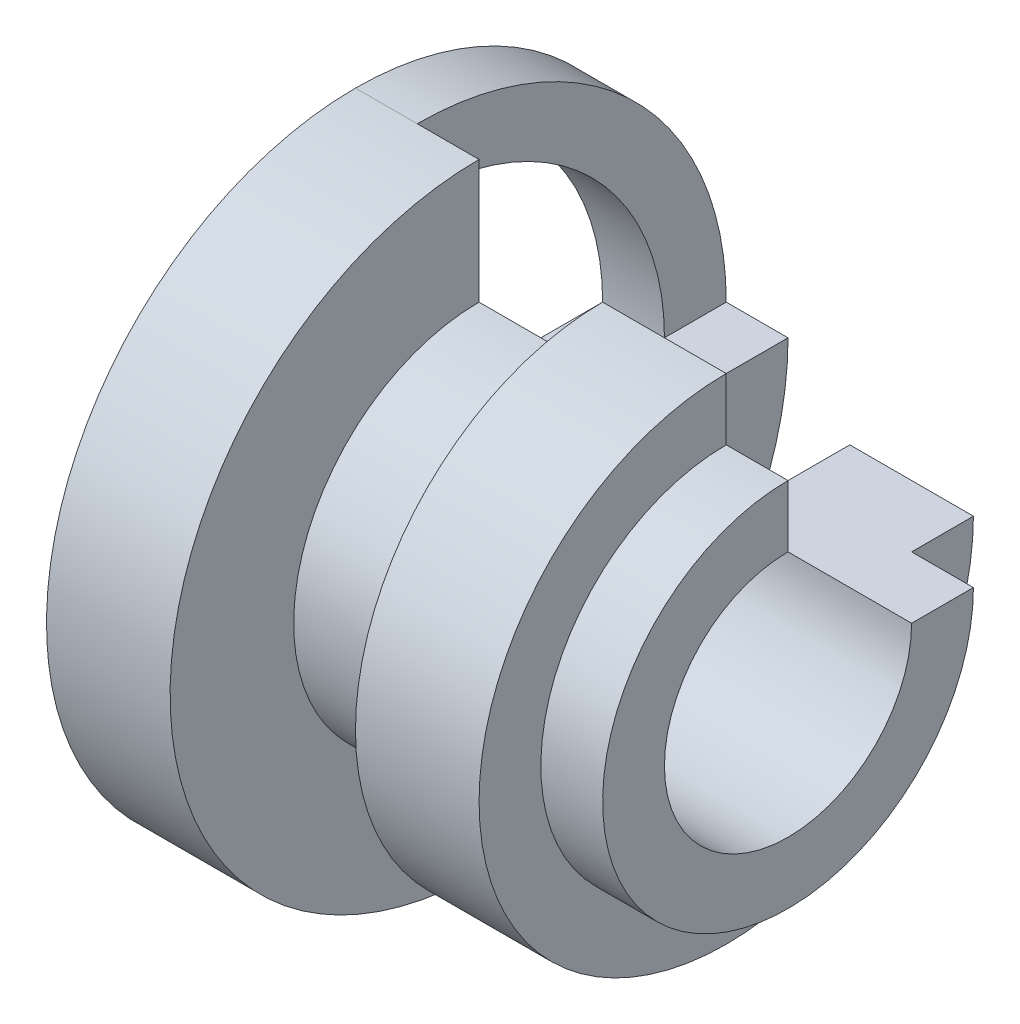
ISO-10303-21;
HEADER;
FILE_DESCRIPTION(('STEP AP214'),'2;1');
FILE_NAME('part.step','',(''),(''),'','','');
FILE_SCHEMA(('AUTOMOTIVE_DESIGN { 1 0 10303 214 1 1 1 1 }'));
ENDSEC;
DATA;
#1=APPLICATION_CONTEXT('core data for automotive mechanical design processes');
#2=APPLICATION_PROTOCOL_DEFINITION('international standard','automotive_design',2000,#1);
#3=PRODUCT_CONTEXT('',#1,'mechanical');
#4=PRODUCT('Part','Part','',(#3));
#5=PRODUCT_RELATED_PRODUCT_CATEGORY('part','',(#4));
#6=PRODUCT_DEFINITION_FORMATION('','',#4);
#7=PRODUCT_DEFINITION_CONTEXT('part definition',#1,'design');
#8=PRODUCT_DEFINITION('design','',#6,#7);
#9=PRODUCT_DEFINITION_SHAPE('','',#8);
#10=(LENGTH_UNIT() NAMED_UNIT(*) SI_UNIT(.MILLI.,.METRE.));
#11=(NAMED_UNIT(*) PLANE_ANGLE_UNIT() SI_UNIT($,.RADIAN.));
#12=(NAMED_UNIT(*) SI_UNIT($,.STERADIAN.) SOLID_ANGLE_UNIT());
#13=UNCERTAINTY_MEASURE_WITH_UNIT(LENGTH_MEASURE(1.E-05),#10,'distance_accuracy_value','');
#14=(GEOMETRIC_REPRESENTATION_CONTEXT(3) GLOBAL_UNCERTAINTY_ASSIGNED_CONTEXT((#13)) GLOBAL_UNIT_ASSIGNED_CONTEXT((#10,
#11,#12)) REPRESENTATION_CONTEXT('',''));
#15=CARTESIAN_POINT('',(0.,0.,0.));
#16=DIRECTION('',(0.,0.,1.));
#17=DIRECTION('',(1.,0.,0.));
#18=AXIS2_PLACEMENT_3D('',#15,#16,#17);
#19=CARTESIAN_POINT('',(1.,0.,0.));
#20=DIRECTION('',(-1.,0.,0.));
#21=DIRECTION('',(0.,0.,1.));
#22=AXIS2_PLACEMENT_3D('',#19,#20,#21);
#23=CYLINDRICAL_SURFACE('',#22,3.99999999999999);
#24=CARTESIAN_POINT('',(0.,0.,0.));
#25=DIRECTION('',(1.,0.,0.));
#26=DIRECTION('',(0.,0.,1.));
#27=AXIS2_PLACEMENT_3D('',#24,#25,#26);
#28=CIRCLE('',#27,3.99999999999999);
#29=CARTESIAN_POINT('',(0.,0.,-4.));
#30=VERTEX_POINT('',#29);
#31=CARTESIAN_POINT('',(0.,4.,0.));
#32=VERTEX_POINT('',#31);
#33=EDGE_CURVE('E107',#30,#32,#28,.T.);
#34=ORIENTED_EDGE('',*,*,#33,.F.);
#35=DIRECTION('',(-1.,0.,0.));
#36=VECTOR('',#35,1.);
#37=CARTESIAN_POINT('',(1.,0.,-4.));
#38=LINE('',#37,#36);
#39=CARTESIAN_POINT('',(1.,0.,-4.));
#40=VERTEX_POINT('',#39);
#41=EDGE_CURVE('E12',#40,#30,#38,.T.);
#42=ORIENTED_EDGE('',*,*,#41,.F.);
#43=CARTESIAN_POINT('',(1.,0.,0.));
#44=DIRECTION('',(1.,0.,0.));
#45=DIRECTION('',(0.,0.,1.));
#46=AXIS2_PLACEMENT_3D('',#43,#44,#45);
#47=CIRCLE('',#46,3.99999999999999);
#48=CARTESIAN_POINT('',(1.,4.,0.));
#49=VERTEX_POINT('',#48);
#50=EDGE_CURVE('E101',#40,#49,#47,.T.);
#51=ORIENTED_EDGE('',*,*,#50,.T.);
#52=DIRECTION('',(-1.,0.,0.));
#53=VECTOR('',#52,1.);
#54=CARTESIAN_POINT('',(1.,4.,0.));
#55=LINE('',#54,#53);
#56=EDGE_CURVE('E46',#49,#32,#55,.T.);
#57=ORIENTED_EDGE('',*,*,#56,.T.);
#58=EDGE_LOOP('',(#34,#42,#51,#57));
#59=FACE_BOUND('',#58,.T.);
#60=ADVANCED_FACE('F43',(#59),#23,.F.);
#61=CARTESIAN_POINT('',(1.,0.,-4.));
#62=DIRECTION('',(0.,-1.,0.));
#63=DIRECTION('',(0.,0.,-1.));
#64=AXIS2_PLACEMENT_3D('',#61,#62,#63);
#65=PLANE('',#64);
#66=DIRECTION('',(0.,0.,1.));
#67=VECTOR('',#66,1.);
#68=CARTESIAN_POINT('',(0.,0.,-4.));
#69=LINE('',#68,#67);
#70=CARTESIAN_POINT('',(0.,0.,-5.));
#71=VERTEX_POINT('',#70);
#72=EDGE_CURVE('E103',#71,#30,#69,.T.);
#73=ORIENTED_EDGE('',*,*,#72,.F.);
#74=DIRECTION('',(-1.,0.,0.));
#75=VECTOR('',#74,1.);
#76=CARTESIAN_POINT('',(1.,0.,-5.));
#77=LINE('',#76,#75);
#78=CARTESIAN_POINT('',(1.,0.,-5.));
#79=VERTEX_POINT('',#78);
#80=EDGE_CURVE('E52',#79,#71,#77,.T.);
#81=ORIENTED_EDGE('',*,*,#80,.F.);
#82=DIRECTION('',(0.,0.,1.));
#83=VECTOR('',#82,1.);
#84=CARTESIAN_POINT('',(1.,0.,-4.));
#85=LINE('',#84,#83);
#86=EDGE_CURVE('E98',#79,#40,#85,.T.);
#87=ORIENTED_EDGE('',*,*,#86,.T.);
#88=ORIENTED_EDGE('',*,*,#41,.T.);
#89=EDGE_LOOP('',(#73,#81,#87,#88));
#90=FACE_BOUND('',#89,.T.);
#91=ADVANCED_FACE('F117',(#90),#65,.T.);
#92=CARTESIAN_POINT('',(1.,0.,0.));
#93=DIRECTION('',(-1.,0.,0.));
#94=DIRECTION('',(0.,0.,1.));
#95=AXIS2_PLACEMENT_3D('',#92,#93,#94);
#96=CYLINDRICAL_SURFACE('',#95,5.00000000000002);
#97=CARTESIAN_POINT('',(0.,0.,0.));
#98=DIRECTION('',(-1.,0.,0.));
#99=DIRECTION('',(0.,0.,-1.));
#100=AXIS2_PLACEMENT_3D('',#97,#98,#99);
#101=CIRCLE('',#100,5.00000000000002);
#102=CARTESIAN_POINT('',(0.,5.,0.));
#103=VERTEX_POINT('',#102);
#104=EDGE_CURVE('E93',#103,#71,#101,.T.);
#105=ORIENTED_EDGE('',*,*,#104,.F.);
#106=DIRECTION('',(-1.,0.,0.));
#107=VECTOR('',#106,1.);
#108=CARTESIAN_POINT('',(1.,5.,0.));
#109=LINE('',#108,#107);
#110=CARTESIAN_POINT('',(1.,5.,0.));
#111=VERTEX_POINT('',#110);
#112=EDGE_CURVE('E88',#111,#103,#109,.T.);
#113=ORIENTED_EDGE('',*,*,#112,.F.);
#114=CARTESIAN_POINT('',(1.,0.,0.));
#115=DIRECTION('',(-1.,0.,0.));
#116=DIRECTION('',(0.,0.,-1.));
#117=AXIS2_PLACEMENT_3D('',#114,#115,#116);
#118=CIRCLE('',#117,5.00000000000002);
#119=EDGE_CURVE('E91',#111,#79,#118,.T.);
#120=ORIENTED_EDGE('',*,*,#119,.T.);
#121=ORIENTED_EDGE('',*,*,#80,.T.);
#122=EDGE_LOOP('',(#105,#113,#120,#121));
#123=FACE_BOUND('',#122,.T.);
#124=ADVANCED_FACE('F90',(#123),#96,.T.);
#125=CARTESIAN_POINT('',(1.,5.,0.));
#126=DIRECTION('',(0.,0.,1.));
#127=DIRECTION('',(0.,-1.,0.));
#128=AXIS2_PLACEMENT_3D('',#125,#126,#127);
#129=PLANE('',#128);
#130=DIRECTION('',(0.,1.,0.));
#131=VECTOR('',#130,1.);
#132=CARTESIAN_POINT('',(0.,5.,0.));
#133=LINE('',#132,#131);
#134=EDGE_CURVE('E110',#32,#103,#133,.T.);
#135=ORIENTED_EDGE('',*,*,#134,.F.);
#136=ORIENTED_EDGE('',*,*,#56,.F.);
#137=DIRECTION('',(0.,1.,0.));
#138=VECTOR('',#137,1.);
#139=CARTESIAN_POINT('',(1.,5.,0.));
#140=LINE('',#139,#138);
#141=EDGE_CURVE('E97',#49,#111,#140,.T.);
#142=ORIENTED_EDGE('',*,*,#141,.T.);
#143=ORIENTED_EDGE('',*,*,#112,.T.);
#144=EDGE_LOOP('',(#135,#136,#142,#143));
#145=FACE_BOUND('',#144,.T.);
#146=ADVANCED_FACE('F100',(#145),#129,.T.);
#147=CARTESIAN_POINT('',(1.,0.,0.));
#148=DIRECTION('',(-1.,0.,0.));
#149=DIRECTION('',(0.,0.,1.));
#150=AXIS2_PLACEMENT_3D('',#147,#148,#149);
#151=PLANE('',#150);
#152=ORIENTED_EDGE('',*,*,#50,.F.);
#153=ORIENTED_EDGE('',*,*,#86,.F.);
#154=ORIENTED_EDGE('',*,*,#119,.F.);
#155=ORIENTED_EDGE('',*,*,#141,.F.);
#156=EDGE_LOOP('',(#152,#153,#154,#155));
#157=FACE_BOUND('',#156,.T.);
#158=ADVANCED_FACE('F96',(#157),#151,.F.);
#159=CARTESIAN_POINT('',(0.,0.,0.));
#160=DIRECTION('',(-1.,0.,0.));
#161=DIRECTION('',(0.,0.,1.));
#162=AXIS2_PLACEMENT_3D('',#159,#160,#161);
#163=PLANE('',#162);
#164=ORIENTED_EDGE('',*,*,#33,.T.);
#165=ORIENTED_EDGE('',*,*,#134,.T.);
#166=ORIENTED_EDGE('',*,*,#104,.T.);
#167=ORIENTED_EDGE('',*,*,#72,.T.);
#168=EDGE_LOOP('',(#164,#165,#166,#167));
#169=FACE_BOUND('',#168,.T.);
#170=ADVANCED_FACE('F116',(#169),#163,.T.);
#171=CLOSED_SHELL('',(#60,#91,#124,#146,#158,#170));
#172=MANIFOLD_SOLID_BREP('B2',#171);
#173=CARTESIAN_POINT('',(0.,0.,0.));
#174=DIRECTION('',(-1.,0.,0.));
#175=DIRECTION('',(0.,0.,1.));
#176=AXIS2_PLACEMENT_3D('',#173,#174,#175);
#177=CYLINDRICAL_SURFACE('',#176,2.);
#178=CARTESIAN_POINT('',(7.00000000000001,0.,0.));
#179=DIRECTION('',(-1.,0.,0.));
#180=DIRECTION('',(0.,0.,1.));
#181=AXIS2_PLACEMENT_3D('',#178,#179,#180);
#182=CIRCLE('',#181,2.);
#183=CARTESIAN_POINT('',(7.00000000000001,0.,-2.));
#184=VERTEX_POINT('',#183);
#185=CARTESIAN_POINT('',(7.00000000000001,2.,0.));
#186=VERTEX_POINT('',#185);
#187=EDGE_CURVE('E41',#184,#186,#182,.T.);
#188=ORIENTED_EDGE('',*,*,#187,.F.);
#189=DIRECTION('',(1.,0.,0.));
#190=VECTOR('',#189,1.);
#191=CARTESIAN_POINT('',(0.,0.,-2.));
#192=LINE('',#191,#190);
#193=CARTESIAN_POINT('',(0.,0.,-2.));
#194=VERTEX_POINT('',#193);
#195=EDGE_CURVE('E284',#194,#184,#192,.T.);
#196=ORIENTED_EDGE('',*,*,#195,.F.);
#197=CARTESIAN_POINT('',(0.,0.,0.));
#198=DIRECTION('',(-1.,0.,0.));
#199=DIRECTION('',(0.,0.,1.));
#200=AXIS2_PLACEMENT_3D('',#197,#198,#199);
#201=CIRCLE('',#200,2.);
#202=CARTESIAN_POINT('',(0.,2.,0.));
#203=VERTEX_POINT('',#202);
#204=EDGE_CURVE('E182',#194,#203,#201,.T.);
#205=ORIENTED_EDGE('',*,*,#204,.T.);
#206=DIRECTION('',(1.,0.,0.));
#207=VECTOR('',#206,1.);
#208=CARTESIAN_POINT('',(0.,2.,0.));
#209=LINE('',#208,#207);
#210=EDGE_CURVE('E254',#203,#186,#209,.T.);
#211=ORIENTED_EDGE('',*,*,#210,.T.);
#212=EDGE_LOOP('',(#188,#196,#205,#211));
#213=FACE_BOUND('',#212,.T.);
#214=ADVANCED_FACE('F167',(#213),#177,.F.);
#215=CARTESIAN_POINT('',(7.,0.,-2.));
#216=DIRECTION('',(-1.,0.,0.));
#217=DIRECTION('',(0.,0.,1.));
#218=AXIS2_PLACEMENT_3D('',#215,#216,#217);
#219=PLANE('',#218);
#220=CARTESIAN_POINT('',(7.,0.,0.));
#221=DIRECTION('',(-1.,0.,0.));
#222=DIRECTION('',(0.,0.,1.));
#223=AXIS2_PLACEMENT_3D('',#220,#221,#222);
#224=CIRCLE('',#223,3.);
#225=CARTESIAN_POINT('',(7.,0.,-3.));
#226=VERTEX_POINT('',#225);
#227=CARTESIAN_POINT('',(7.,3.,0.));
#228=VERTEX_POINT('',#227);
#229=EDGE_CURVE('E175',#226,#228,#224,.T.);
#230=ORIENTED_EDGE('',*,*,#229,.F.);
#231=DIRECTION('',(0.,0.,-1.));
#232=VECTOR('',#231,1.);
#233=CARTESIAN_POINT('',(7.00000000000001,0.,-2.));
#234=LINE('',#233,#232);
#235=EDGE_CURVE('E250',#184,#226,#234,.T.);
#236=ORIENTED_EDGE('',*,*,#235,.F.);
#237=ORIENTED_EDGE('',*,*,#187,.T.);
#238=DIRECTION('',(0.,1.,0.));
#239=VECTOR('',#238,1.);
#240=CARTESIAN_POINT('',(7.00000000000001,2.,0.));
#241=LINE('',#240,#239);
#242=EDGE_CURVE('E247',#186,#228,#241,.T.);
#243=ORIENTED_EDGE('',*,*,#242,.T.);
#244=EDGE_LOOP('',(#230,#236,#237,#243));
#245=FACE_BOUND('',#244,.T.);
#246=ADVANCED_FACE('F169',(#245),#219,.F.);
#247=CARTESIAN_POINT('',(0.,0.,0.));
#248=DIRECTION('',(-1.,0.,0.));
#249=DIRECTION('',(0.,0.,1.));
#250=AXIS2_PLACEMENT_3D('',#247,#248,#249);
#251=CYLINDRICAL_SURFACE('',#250,3.);
#252=CARTESIAN_POINT('',(6.,0.,0.));
#253=DIRECTION('',(-1.,0.,0.));
#254=DIRECTION('',(0.,0.,1.));
#255=AXIS2_PLACEMENT_3D('',#252,#253,#254);
#256=CIRCLE('',#255,3.);
#257=CARTESIAN_POINT('',(6.,0.,-3.));
#258=VERTEX_POINT('',#257);
#259=CARTESIAN_POINT('',(6.,3.,0.));
#260=VERTEX_POINT('',#259);
#261=EDGE_CURVE('E322',#258,#260,#256,.T.);
#262=ORIENTED_EDGE('',*,*,#261,.F.);
#263=DIRECTION('',(-1.,0.,0.));
#264=VECTOR('',#263,1.);
#265=CARTESIAN_POINT('',(7.,0.,-3.));
#266=LINE('',#265,#264);
#267=EDGE_CURVE('E287',#226,#258,#266,.T.);
#268=ORIENTED_EDGE('',*,*,#267,.F.);
#269=ORIENTED_EDGE('',*,*,#229,.T.);
#270=DIRECTION('',(-1.,0.,0.));
#271=VECTOR('',#270,1.);
#272=CARTESIAN_POINT('',(7.,3.,0.));
#273=LINE('',#272,#271);
#274=EDGE_CURVE('E261',#228,#260,#273,.T.);
#275=ORIENTED_EDGE('',*,*,#274,.T.);
#276=EDGE_LOOP('',(#262,#268,#269,#275));
#277=FACE_BOUND('',#276,.T.);
#278=ADVANCED_FACE('F325',(#277),#251,.T.);
#279=CARTESIAN_POINT('',(6.,0.,-3.));
#280=DIRECTION('',(-1.,0.,0.));
#281=DIRECTION('',(0.,0.,1.));
#282=AXIS2_PLACEMENT_3D('',#279,#280,#281);
#283=PLANE('',#282);
#284=CARTESIAN_POINT('',(6.,0.,0.));
#285=DIRECTION('',(-1.,0.,0.));
#286=DIRECTION('',(0.,0.,1.));
#287=AXIS2_PLACEMENT_3D('',#284,#285,#286);
#288=CIRCLE('',#287,4.);
#289=CARTESIAN_POINT('',(6.,0.,-4.));
#290=VERTEX_POINT('',#289);
#291=CARTESIAN_POINT('',(6.,4.,0.));
#292=VERTEX_POINT('',#291);
#293=EDGE_CURVE('E320',#290,#292,#288,.T.);
#294=ORIENTED_EDGE('',*,*,#293,.F.);
#295=DIRECTION('',(0.,0.,-1.));
#296=VECTOR('',#295,1.);
#297=CARTESIAN_POINT('',(6.,0.,-3.));
#298=LINE('',#297,#296);
#299=EDGE_CURVE('E290',#258,#290,#298,.T.);
#300=ORIENTED_EDGE('',*,*,#299,.F.);
#301=ORIENTED_EDGE('',*,*,#261,.T.);
#302=DIRECTION('',(0.,1.,0.));
#303=VECTOR('',#302,1.);
#304=CARTESIAN_POINT('',(6.,3.,0.));
#305=LINE('',#304,#303);
#306=EDGE_CURVE('E263',#260,#292,#305,.T.);
#307=ORIENTED_EDGE('',*,*,#306,.T.);
#308=EDGE_LOOP('',(#294,#300,#301,#307));
#309=FACE_BOUND('',#308,.T.);
#310=ADVANCED_FACE('F349',(#309),#283,.F.);
#311=CARTESIAN_POINT('',(0.,0.,0.));
#312=DIRECTION('',(-1.,0.,0.));
#313=DIRECTION('',(0.,0.,1.));
#314=AXIS2_PLACEMENT_3D('',#311,#312,#313);
#315=CYLINDRICAL_SURFACE('',#314,4.);
#316=CARTESIAN_POINT('',(4.,0.,0.));
#317=DIRECTION('',(-1.,0.,0.));
#318=DIRECTION('',(0.,0.,1.));
#319=AXIS2_PLACEMENT_3D('',#316,#317,#318);
#320=CIRCLE('',#319,4.);
#321=CARTESIAN_POINT('',(4.,0.,-4.));
#322=VERTEX_POINT('',#321);
#323=CARTESIAN_POINT('',(4.,4.,0.));
#324=VERTEX_POINT('',#323);
#325=EDGE_CURVE('E318',#322,#324,#320,.T.);
#326=ORIENTED_EDGE('',*,*,#325,.F.);
#327=DIRECTION('',(-1.,0.,0.));
#328=VECTOR('',#327,1.);
#329=CARTESIAN_POINT('',(6.,0.,-4.));
#330=LINE('',#329,#328);
#331=EDGE_CURVE('E293',#290,#322,#330,.T.);
#332=ORIENTED_EDGE('',*,*,#331,.F.);
#333=ORIENTED_EDGE('',*,*,#293,.T.);
#334=DIRECTION('',(-1.,0.,0.));
#335=VECTOR('',#334,1.);
#336=CARTESIAN_POINT('',(6.,4.,0.));
#337=LINE('',#336,#335);
#338=EDGE_CURVE('E268',#292,#324,#337,.T.);
#339=ORIENTED_EDGE('',*,*,#338,.T.);
#340=EDGE_LOOP('',(#326,#332,#333,#339));
#341=FACE_BOUND('',#340,.T.);
#342=ADVANCED_FACE('F346',(#341),#315,.T.);
#343=CARTESIAN_POINT('',(4.,0.,-4.));
#344=DIRECTION('',(1.,0.,0.));
#345=DIRECTION('',(0.,0.,-1.));
#346=AXIS2_PLACEMENT_3D('',#343,#344,#345);
#347=PLANE('',#346);
#348=CARTESIAN_POINT('',(4.,0.,0.));
#349=DIRECTION('',(-1.,0.,0.));
#350=DIRECTION('',(0.,0.,1.));
#351=AXIS2_PLACEMENT_3D('',#348,#349,#350);
#352=CIRCLE('',#351,3.);
#353=CARTESIAN_POINT('',(4.,0.,-3.));
#354=VERTEX_POINT('',#353);
#355=CARTESIAN_POINT('',(4.,3.,0.));
#356=VERTEX_POINT('',#355);
#357=EDGE_CURVE('E316',#354,#356,#352,.T.);
#358=ORIENTED_EDGE('',*,*,#357,.F.);
#359=DIRECTION('',(0.,0.,1.));
#360=VECTOR('',#359,1.);
#361=CARTESIAN_POINT('',(4.,0.,-4.));
#362=LINE('',#361,#360);
#363=EDGE_CURVE('E296',#322,#354,#362,.T.);
#364=ORIENTED_EDGE('',*,*,#363,.F.);
#365=ORIENTED_EDGE('',*,*,#325,.T.);
#366=DIRECTION('',(0.,-1.,0.));
#367=VECTOR('',#366,1.);
#368=CARTESIAN_POINT('',(4.,4.,0.));
#369=LINE('',#368,#367);
#370=EDGE_CURVE('E271',#324,#356,#369,.T.);
#371=ORIENTED_EDGE('',*,*,#370,.T.);
#372=EDGE_LOOP('',(#358,#364,#365,#371));
#373=FACE_BOUND('',#372,.T.);
#374=ADVANCED_FACE('F343',(#373),#347,.F.);
#375=CARTESIAN_POINT('',(0.,0.,0.));
#376=DIRECTION('',(-1.,0.,0.));
#377=DIRECTION('',(0.,0.,1.));
#378=AXIS2_PLACEMENT_3D('',#375,#376,#377);
#379=CYLINDRICAL_SURFACE('',#378,3.);
#380=CARTESIAN_POINT('',(2.,0.,0.));
#381=DIRECTION('',(-1.,0.,0.));
#382=DIRECTION('',(0.,0.,1.));
#383=AXIS2_PLACEMENT_3D('',#380,#381,#382);
#384=CIRCLE('',#383,3.);
#385=CARTESIAN_POINT('',(2.,0.,-3.));
#386=VERTEX_POINT('',#385);
#387=CARTESIAN_POINT('',(2.,3.,0.));
#388=VERTEX_POINT('',#387);
#389=EDGE_CURVE('E314',#386,#388,#384,.T.);
#390=ORIENTED_EDGE('',*,*,#389,.F.);
#391=DIRECTION('',(-1.,0.,0.));
#392=VECTOR('',#391,1.);
#393=CARTESIAN_POINT('',(4.,0.,-3.));
#394=LINE('',#393,#392);
#395=EDGE_CURVE('E299',#354,#386,#394,.T.);
#396=ORIENTED_EDGE('',*,*,#395,.F.);
#397=ORIENTED_EDGE('',*,*,#357,.T.);
#398=DIRECTION('',(-1.,0.,0.));
#399=VECTOR('',#398,1.);
#400=CARTESIAN_POINT('',(4.,3.,0.));
#401=LINE('',#400,#399);
#402=EDGE_CURVE('E274',#356,#388,#401,.T.);
#403=ORIENTED_EDGE('',*,*,#402,.T.);
#404=EDGE_LOOP('',(#390,#396,#397,#403));
#405=FACE_BOUND('',#404,.T.);
#406=ADVANCED_FACE('F340',(#405),#379,.T.);
#407=CARTESIAN_POINT('',(2.,0.,-3.));
#408=DIRECTION('',(-1.,0.,0.));
#409=DIRECTION('',(0.,0.,1.));
#410=AXIS2_PLACEMENT_3D('',#407,#408,#409);
#411=PLANE('',#410);
#412=CARTESIAN_POINT('',(2.,0.,0.));
#413=DIRECTION('',(-1.,0.,0.));
#414=DIRECTION('',(0.,0.,1.));
#415=AXIS2_PLACEMENT_3D('',#412,#413,#414);
#416=CIRCLE('',#415,5.);
#417=CARTESIAN_POINT('',(2.,0.,-5.));
#418=VERTEX_POINT('',#417);
#419=CARTESIAN_POINT('',(2.,5.,0.));
#420=VERTEX_POINT('',#419);
#421=EDGE_CURVE('E312',#418,#420,#416,.T.);
#422=ORIENTED_EDGE('',*,*,#421,.F.);
#423=DIRECTION('',(0.,0.,-1.));
#424=VECTOR('',#423,1.);
#425=CARTESIAN_POINT('',(2.,0.,-3.));
#426=LINE('',#425,#424);
#427=EDGE_CURVE('E302',#386,#418,#426,.T.);
#428=ORIENTED_EDGE('',*,*,#427,.F.);
#429=ORIENTED_EDGE('',*,*,#389,.T.);
#430=DIRECTION('',(0.,1.,0.));
#431=VECTOR('',#430,1.);
#432=CARTESIAN_POINT('',(2.,3.,0.));
#433=LINE('',#432,#431);
#434=EDGE_CURVE('E277',#388,#420,#433,.T.);
#435=ORIENTED_EDGE('',*,*,#434,.T.);
#436=EDGE_LOOP('',(#422,#428,#429,#435));
#437=FACE_BOUND('',#436,.T.);
#438=ADVANCED_FACE('F336',(#437),#411,.F.);
#439=CARTESIAN_POINT('',(0.,0.,0.));
#440=DIRECTION('',(-1.,0.,0.));
#441=DIRECTION('',(0.,0.,1.));
#442=AXIS2_PLACEMENT_3D('',#439,#440,#441);
#443=CYLINDRICAL_SURFACE('',#442,5.);
#444=CARTESIAN_POINT('',(0.,0.,0.));
#445=DIRECTION('',(-1.,0.,0.));
#446=DIRECTION('',(0.,0.,1.));
#447=AXIS2_PLACEMENT_3D('',#444,#445,#446);
#448=CIRCLE('',#447,5.);
#449=CARTESIAN_POINT('',(0.,0.,-5.));
#450=VERTEX_POINT('',#449);
#451=CARTESIAN_POINT('',(0.,5.,0.));
#452=VERTEX_POINT('',#451);
#453=EDGE_CURVE('E190',#450,#452,#448,.T.);
#454=ORIENTED_EDGE('',*,*,#453,.F.);
#455=DIRECTION('',(-1.,0.,0.));
#456=VECTOR('',#455,1.);
#457=CARTESIAN_POINT('',(2.,0.,-5.));
#458=LINE('',#457,#456);
#459=EDGE_CURVE('E305',#418,#450,#458,.T.);
#460=ORIENTED_EDGE('',*,*,#459,.F.);
#461=ORIENTED_EDGE('',*,*,#421,.T.);
#462=DIRECTION('',(-1.,0.,0.));
#463=VECTOR('',#462,1.);
#464=CARTESIAN_POINT('',(2.,5.,0.));
#465=LINE('',#464,#463);
#466=EDGE_CURVE('E280',#420,#452,#465,.T.);
#467=ORIENTED_EDGE('',*,*,#466,.T.);
#468=EDGE_LOOP('',(#454,#460,#461,#467));
#469=FACE_BOUND('',#468,.T.);
#470=ADVANCED_FACE('F331',(#469),#443,.T.);
#471=CARTESIAN_POINT('',(0.,0.,-5.));
#472=DIRECTION('',(1.,0.,0.));
#473=DIRECTION('',(0.,0.,-1.));
#474=AXIS2_PLACEMENT_3D('',#471,#472,#473);
#475=PLANE('',#474);
#476=DIRECTION('',(0.,0.,1.));
#477=VECTOR('',#476,1.);
#478=CARTESIAN_POINT('',(0.,0.,-5.));
#479=LINE('',#478,#477);
#480=EDGE_CURVE('E307',#450,#194,#479,.T.);
#481=ORIENTED_EDGE('',*,*,#480,.F.);
#482=ORIENTED_EDGE('',*,*,#453,.T.);
#483=DIRECTION('',(0.,-1.,0.));
#484=VECTOR('',#483,1.);
#485=CARTESIAN_POINT('',(0.,5.,0.));
#486=LINE('',#485,#484);
#487=EDGE_CURVE('E282',#452,#203,#486,.T.);
#488=ORIENTED_EDGE('',*,*,#487,.T.);
#489=ORIENTED_EDGE('',*,*,#204,.F.);
#490=EDGE_LOOP('',(#481,#482,#488,#489));
#491=FACE_BOUND('',#490,.T.);
#492=ADVANCED_FACE('F329',(#491),#475,.F.);
#493=CARTESIAN_POINT('',(0.,0.,0.));
#494=DIRECTION('',(0.,1.,0.));
#495=DIRECTION('',(1.,0.,0.));
#496=AXIS2_PLACEMENT_3D('',#493,#494,#495);
#497=PLANE('',#496);
#498=ORIENTED_EDGE('',*,*,#195,.T.);
#499=ORIENTED_EDGE('',*,*,#235,.T.);
#500=ORIENTED_EDGE('',*,*,#267,.T.);
#501=ORIENTED_EDGE('',*,*,#299,.T.);
#502=ORIENTED_EDGE('',*,*,#331,.T.);
#503=ORIENTED_EDGE('',*,*,#363,.T.);
#504=ORIENTED_EDGE('',*,*,#395,.T.);
#505=ORIENTED_EDGE('',*,*,#427,.T.);
#506=ORIENTED_EDGE('',*,*,#459,.T.);
#507=ORIENTED_EDGE('',*,*,#480,.T.);
#508=EDGE_LOOP('',(#498,#499,#500,#501,#502,#503,#504,#505,#506,#507));
#509=FACE_BOUND('',#508,.T.);
#510=ADVANCED_FACE('F327',(#509),#497,.T.);
#511=CARTESIAN_POINT('',(0.,0.,0.));
#512=DIRECTION('',(0.,0.,1.));
#513=DIRECTION('',(1.,0.,0.));
#514=AXIS2_PLACEMENT_3D('',#511,#512,#513);
#515=PLANE('',#514);
#516=ORIENTED_EDGE('',*,*,#210,.F.);
#517=ORIENTED_EDGE('',*,*,#487,.F.);
#518=ORIENTED_EDGE('',*,*,#466,.F.);
#519=ORIENTED_EDGE('',*,*,#434,.F.);
#520=ORIENTED_EDGE('',*,*,#402,.F.);
#521=ORIENTED_EDGE('',*,*,#370,.F.);
#522=ORIENTED_EDGE('',*,*,#338,.F.);
#523=ORIENTED_EDGE('',*,*,#306,.F.);
#524=ORIENTED_EDGE('',*,*,#274,.F.);
#525=ORIENTED_EDGE('',*,*,#242,.F.);
#526=EDGE_LOOP('',(#516,#517,#518,#519,#520,#521,#522,#523,#524,#525));
#527=FACE_BOUND('',#526,.T.);
#528=ADVANCED_FACE('F258',(#527),#515,.F.);
#529=CLOSED_SHELL('',(#214,#246,#278,#310,#342,#374,#406,#438,#470,#492,#510,#528));
#530=MANIFOLD_SOLID_BREP('B6',#529);
#531=ADVANCED_BREP_SHAPE_REPRESENTATION('',(#18,#172,#530),#14);
#532=SHAPE_DEFINITION_REPRESENTATION(#9,#531);
ENDSEC;
END-ISO-10303-21;
